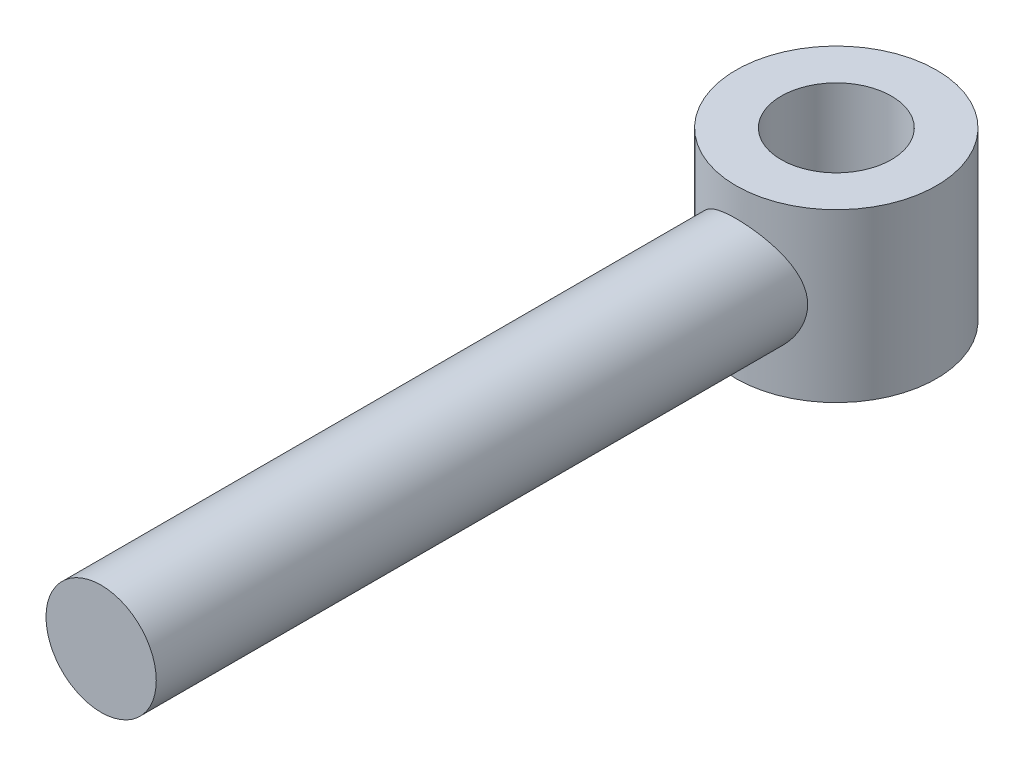
ISO-10303-21;
HEADER;
FILE_DESCRIPTION(('STEP AP214'),'2;1');
FILE_NAME('part.step','',(''),(''),'','','');
FILE_SCHEMA(('AUTOMOTIVE_DESIGN { 1 0 10303 214 1 1 1 1 }'));
ENDSEC;
DATA;
#1=APPLICATION_CONTEXT('core data for automotive mechanical design processes');
#2=APPLICATION_PROTOCOL_DEFINITION('international standard','automotive_design',2000,#1);
#3=PRODUCT_CONTEXT('',#1,'mechanical');
#4=PRODUCT('Part','Part','',(#3));
#5=PRODUCT_RELATED_PRODUCT_CATEGORY('part','',(#4));
#6=PRODUCT_DEFINITION_FORMATION('','',#4);
#7=PRODUCT_DEFINITION_CONTEXT('part definition',#1,'design');
#8=PRODUCT_DEFINITION('design','',#6,#7);
#9=PRODUCT_DEFINITION_SHAPE('','',#8);
#10=(LENGTH_UNIT() NAMED_UNIT(*) SI_UNIT(.MILLI.,.METRE.));
#11=(NAMED_UNIT(*) PLANE_ANGLE_UNIT() SI_UNIT($,.RADIAN.));
#12=(NAMED_UNIT(*) SI_UNIT($,.STERADIAN.) SOLID_ANGLE_UNIT());
#13=UNCERTAINTY_MEASURE_WITH_UNIT(LENGTH_MEASURE(1.E-05),#10,'distance_accuracy_value','');
#14=(GEOMETRIC_REPRESENTATION_CONTEXT(3) GLOBAL_UNCERTAINTY_ASSIGNED_CONTEXT((#13)) GLOBAL_UNIT_ASSIGNED_CONTEXT((#10,
#11,#12)) REPRESENTATION_CONTEXT('',''));
#15=CARTESIAN_POINT('',(0.,0.,0.));
#16=DIRECTION('',(0.,0.,1.));
#17=DIRECTION('',(1.,0.,0.));
#18=AXIS2_PLACEMENT_3D('',#15,#16,#17);
#19=CARTESIAN_POINT('',(0.,0.,20.));
#20=DIRECTION('',(0.,0.,-1.));
#21=DIRECTION('',(-1.,0.,0.));
#22=AXIS2_PLACEMENT_3D('',#19,#20,#21);
#23=CYLINDRICAL_SURFACE('',#22,1.65);
#24=CARTESIAN_POINT('',(0.,0.,20.));
#25=DIRECTION('',(0.,0.,1.));
#26=DIRECTION('',(1.,0.,0.));
#27=AXIS2_PLACEMENT_3D('',#24,#25,#26);
#28=CIRCLE('',#27,1.65);
#29=CARTESIAN_POINT('',(1.65,0.,20.));
#30=VERTEX_POINT('',#29);
#31=EDGE_CURVE('E40',#30,#30,#28,.T.);
#32=ORIENTED_EDGE('',*,*,#31,.F.);
#33=EDGE_LOOP('',(#32));
#34=FACE_BOUND('',#33,.T.);
#35=CARTESIAN_POINT('',(-1.65,0.,0.505493963273512));
#36=CARTESIAN_POINT('',(-1.64999358115515,0.0845622441242158,0.505502907291454));
#37=CARTESIAN_POINT('',(-1.64345412095508,0.169198419643748,0.509842783046335));
#38=CARTESIAN_POINT('',(-1.61768357796129,0.335758010656105,0.526523054720934));
#39=CARTESIAN_POINT('',(-1.5984310983052,0.417676607737088,0.538876938133396));
#40=CARTESIAN_POINT('',(-1.54839133504121,0.576058158341647,0.569695144240605));
#41=CARTESIAN_POINT('',(-1.51767597794516,0.652551663639783,0.588121282537674));
#42=CARTESIAN_POINT('',(-1.44580368027316,0.799270749323263,0.62894573960704));
#43=CARTESIAN_POINT('',(-1.40464456372702,0.869495019378769,0.651344885867393));
#44=CARTESIAN_POINT('',(-1.30818987552103,1.0094930204861,0.700342271694853));
#45=CARTESIAN_POINT('',(-1.25188597568528,1.07850385692035,0.72713610292843));
#46=CARTESIAN_POINT('',(-1.12882249865068,1.20671542475616,0.780334021223294));
#47=CARTESIAN_POINT('',(-1.06205670422282,1.26591027944563,0.806737866250299));
#48=CARTESIAN_POINT('',(-0.912984038802343,1.37781278752496,0.858882553339562));
#49=CARTESIAN_POINT('',(-0.829835009326254,1.42952708912563,0.884371828723282));
#50=CARTESIAN_POINT('',(-0.654349556397894,1.51787790618033,0.929163774647794));
#51=CARTESIAN_POINT('',(-0.562020200659685,1.55452591089576,0.948471156884162));
#52=CARTESIAN_POINT('',(-0.378922854343172,1.60849398479963,0.977293823303904));
#53=CARTESIAN_POINT('',(-0.288663762188309,1.62716814327195,0.987490006205549));
#54=CARTESIAN_POINT('',(-0.105768848971925,1.64917477835194,0.99953120217528));
#55=CARTESIAN_POINT('',(-0.0131348834272881,1.65251888599857,1.00138254652496));
#56=CARTESIAN_POINT('',(0.161456942743377,1.6441598762631,0.996791263837074));
#57=CARTESIAN_POINT('',(0.243517036042416,1.63399569896197,0.991196805882625));
#58=CARTESIAN_POINT('',(0.404548934713679,1.60174386066673,0.973701390906371));
#59=CARTESIAN_POINT('',(0.483520502425807,1.57965528402605,0.961799949587434));
#60=CARTESIAN_POINT('',(0.637279429786406,1.52418240454989,0.932587921332845));
#61=CARTESIAN_POINT('',(0.712012587065491,1.49067904874512,0.915220477375491));
#62=CARTESIAN_POINT('',(0.854941741305337,1.41356855385775,0.876554219394163));
#63=CARTESIAN_POINT('',(0.923135637298119,1.36995818281495,0.855254148262444));
#64=CARTESIAN_POINT('',(1.05891717191853,1.26851524995847,0.807918143824378));
#65=CARTESIAN_POINT('',(1.12564617195586,1.2096560691274,0.781619201725346));
#66=CARTESIAN_POINT('',(1.24879377983835,1.08207579455025,0.728556379997795));
#67=CARTESIAN_POINT('',(1.3052016470546,1.01334455874152,0.701792047413865));
#68=CARTESIAN_POINT('',(1.41104757147093,0.860702045770571,0.648162607413785));
#69=CARTESIAN_POINT('',(1.45943898084593,0.77598782502349,0.621494935575282));
#70=CARTESIAN_POINT('',(1.54096072440202,0.5979123412443,0.574426694548113));
#71=CARTESIAN_POINT('',(1.57410870202277,0.504561226104887,0.554018889066321));
#72=CARTESIAN_POINT('',(1.621324807476,0.319617566085951,0.524288688853718));
#73=CARTESIAN_POINT('',(1.63671808149072,0.228492292818842,0.514203881757541));
#74=CARTESIAN_POINT('',(1.65197600548299,0.0444385673954552,0.504211322839311));
#75=CARTESIAN_POINT('',(1.65185841284551,-0.048487701005198,0.504291933285543));
#76=CARTESIAN_POINT('',(1.63731066997579,-0.218980696775525,0.51381291635781));
#77=CARTESIAN_POINT('',(1.6249632757909,-0.296816762788183,0.521891182807725));
#78=CARTESIAN_POINT('',(1.58963092545288,-0.449094842708403,0.544308983162269));
#79=CARTESIAN_POINT('',(1.56664130047228,-0.523535351197223,0.558651264981769));
#80=CARTESIAN_POINT('',(1.50974087534156,-0.670568414340693,0.592647010529621));
#81=CARTESIAN_POINT('',(1.47541058671725,-0.742950820695036,0.612498861958533));
#82=CARTESIAN_POINT('',(1.39715088074391,-0.881361532982981,0.655175256281805));
#83=CARTESIAN_POINT('',(1.35321671440463,-0.947386671982585,0.67800126759515));
#84=CARTESIAN_POINT('',(1.24890384728535,-1.08217598283305,0.728387459802587));
#85=CARTESIAN_POINT('',(1.18702256034847,-1.14971665545364,0.756124712105424));
#86=CARTESIAN_POINT('',(1.05259034248067,-1.27394463458245,0.810214664772877));
#87=CARTESIAN_POINT('',(0.980033198593373,-1.33062557660595,0.836566546699512));
#88=CARTESIAN_POINT('',(0.821591432017619,-1.43418356477834,0.886558861743433));
#89=CARTESIAN_POINT('',(0.735218364495385,-1.48041980778174,0.909994762848855));
#90=CARTESIAN_POINT('',(0.554269536180263,-1.55721430537587,0.949802248986286));
#91=CARTESIAN_POINT('',(0.459702424085392,-1.58778886056153,0.966181176042924));
#92=CARTESIAN_POINT('',(0.275417797995456,-1.62930611839183,0.988623250679751));
#93=CARTESIAN_POINT('',(0.186187129425337,-1.64193096934435,0.995567054324279));
#94=CARTESIAN_POINT('',(0.00661676308886458,-1.65243189343455,1.00133436858647));
#95=CARTESIAN_POINT('',(-0.0837223254250938,-1.65031573581962,1.00016215675142));
#96=CARTESIAN_POINT('',(-0.254358366297032,-1.63233007153813,0.990310424275243));
#97=CARTESIAN_POINT('',(-0.334831363047834,-1.61770633320566,0.982311046718285));
#98=CARTESIAN_POINT('',(-0.491985833876879,-1.57703517800952,0.960447010253794));
#99=CARTESIAN_POINT('',(-0.568666854326148,-1.55098639804466,0.946581651493577));
#100=CARTESIAN_POINT('',(-0.719080279481093,-1.48738736796038,0.91359875185443));
#101=CARTESIAN_POINT('',(-0.792622296205403,-1.44947440595497,0.894317879409316));
#102=CARTESIAN_POINT('',(-0.932542405269455,-1.36367449851232,0.85231650614788));
#103=CARTESIAN_POINT('',(-0.99891758384472,-1.31578351940048,0.829594615296545));
#104=CARTESIAN_POINT('',(-1.13072210629174,-1.20507399834962,0.779745171250151));
#105=CARTESIAN_POINT('',(-1.19516495605846,-1.14117216627433,0.752411459408138));
#106=CARTESIAN_POINT('',(-1.31290440702821,-1.00349286244808,0.698238785370544));
#107=CARTESIAN_POINT('',(-1.36618742691371,-0.929703534726652,0.671400461841619));
#108=CARTESIAN_POINT('',(-1.46345962344263,-0.76827599994856,0.619451080889308));
#109=CARTESIAN_POINT('',(-1.50659692748028,-0.680043601407346,0.594572990896039));
#110=CARTESIAN_POINT('',(-1.57680093269354,-0.495821199591316,0.552528855842846));
#111=CARTESIAN_POINT('',(-1.60391885150154,-0.399857047171827,0.535338275367573));
#112=CARTESIAN_POINT('',(-1.6313948659609,-0.252191216941535,0.517669254132097));
#113=CARTESIAN_POINT('',(-1.6383544404993,-0.20212523584003,0.513130626131419));
#114=CARTESIAN_POINT('',(-1.64765888075615,-0.101381687592519,0.507040332364648));
#115=CARTESIAN_POINT('',(-1.65000384878586,-0.0507041340308588,0.505488600375576));
#116=CARTESIAN_POINT('',(-1.65,0.,0.505493963273512));
#117=B_SPLINE_CURVE_WITH_KNOTS('',3,(#35,#36,#37,#38,#39,#40,#41,#42,#43,#44,#45,#46,#47,#48,
#49,#50,#51,#52,#53,#54,#55,#56,#57,#58,#59,#60,#61,#62,#63,#64,#65,#66,#67,#68,#69,#70,#71,#72,
#73,#74,#75,#76,#77,#78,#79,#80,#81,#82,#83,#84,#85,#86,#87,#88,#89,#90,#91,#92,#93,#94,#95,#96,
#97,#98,#99,#100,#101,#102,#103,#104,#105,#106,#107,#108,#109,#110,#111,#112,#113,#114,#115,
#116),.UNSPECIFIED.,.T.,.F.,(4,2,2,2,2,2,2,2,2,2,2,2,2,2,2,2,2,2,2,2,2,2,2,2,2,2,2,2,2,2,2,2,2,
2,2,2,2,2,2,2,4),(0.,0.253471464978916,0.507370630471963,0.759702723718416,1.01208743389991,
1.28998079678324,1.56803993512379,1.86997289364919,2.17167517502776,2.44828286528195,
2.72468065617498,2.9721366309398,3.21961160997027,3.46975098230538,3.71997045333205,
3.99717687977863,4.27467015892956,4.57652503396566,4.8780296436106,5.15517475627462,
5.43200258623579,5.66859462056208,5.90529054812099,6.15196333618108,6.39875837770523,
6.68465599353131,6.97072065421035,7.27125286686233,7.57147164850534,7.84111747203333,
8.1106211895083,8.35604451303954,8.60149712555499,8.85533990697406,9.10928550569675,
9.39243346006448,9.67592402360688,9.97823556729934,10.2795752459721,10.4315619419379,
10.5835452681421),.UNSPECIFIED.);
#118=CARTESIAN_POINT('',(-1.65,0.,0.505493963273512));
#119=VERTEX_POINT('',#118);
#120=EDGE_CURVE('E10',#119,#119,#117,.T.);
#121=ORIENTED_EDGE('',*,*,#120,.F.);
#122=EDGE_LOOP('',(#121));
#123=FACE_BOUND('',#122,.T.);
#124=ADVANCED_FACE('F30',(#34,#123),#23,.T.);
#125=CARTESIAN_POINT('',(0.,0.,20.));
#126=DIRECTION('',(0.,0.,1.));
#127=DIRECTION('',(1.,0.,0.));
#128=AXIS2_PLACEMENT_3D('',#125,#126,#127);
#129=PLANE('',#128);
#130=ORIENTED_EDGE('',*,*,#31,.T.);
#131=EDGE_LOOP('',(#130));
#132=FACE_BOUND('',#131,.T.);
#133=ADVANCED_FACE('F77',(#132),#129,.T.);
#134=CARTESIAN_POINT('',(0.,2.5,-2.));
#135=DIRECTION('',(0.,-1.,0.));
#136=DIRECTION('',(0.,0.,-1.));
#137=AXIS2_PLACEMENT_3D('',#134,#135,#136);
#138=CYLINDRICAL_SURFACE('',#137,3.);
#139=CARTESIAN_POINT('',(0.,-2.5,-2.));
#140=DIRECTION('',(0.,1.,0.));
#141=DIRECTION('',(0.,0.,1.));
#142=AXIS2_PLACEMENT_3D('',#139,#140,#141);
#143=CIRCLE('',#142,3.);
#144=CARTESIAN_POINT('',(0.,-2.5,1.));
#145=VERTEX_POINT('',#144);
#146=EDGE_CURVE('E48',#145,#145,#143,.T.);
#147=ORIENTED_EDGE('',*,*,#146,.T.);
#148=EDGE_LOOP('',(#147));
#149=FACE_BOUND('',#148,.T.);
#150=CARTESIAN_POINT('',(0.,2.5,-2.));
#151=DIRECTION('',(0.,1.,0.));
#152=DIRECTION('',(0.,0.,1.));
#153=AXIS2_PLACEMENT_3D('',#150,#151,#152);
#154=CIRCLE('',#153,3.);
#155=CARTESIAN_POINT('',(0.,2.5,1.));
#156=VERTEX_POINT('',#155);
#157=EDGE_CURVE('E44',#156,#156,#154,.T.);
#158=ORIENTED_EDGE('',*,*,#157,.F.);
#159=EDGE_LOOP('',(#158));
#160=FACE_BOUND('',#159,.T.);
#161=ORIENTED_EDGE('',*,*,#120,.T.);
#162=EDGE_LOOP('',(#161));
#163=FACE_BOUND('',#162,.T.);
#164=ADVANCED_FACE('F72',(#149,#160,#163),#138,.T.);
#165=CARTESIAN_POINT('',(0.,2.5,-2.));
#166=DIRECTION('',(0.,1.,0.));
#167=DIRECTION('',(0.,0.,1.));
#168=AXIS2_PLACEMENT_3D('',#165,#166,#167);
#169=PLANE('',#168);
#170=CARTESIAN_POINT('',(0.,2.5,-2.00107941551053));
#171=DIRECTION('',(0.,1.,0.));
#172=DIRECTION('',(0.,0.,1.));
#173=AXIS2_PLACEMENT_3D('',#170,#171,#172);
#174=CIRCLE('',#173,1.65);
#175=CARTESIAN_POINT('',(0.,2.5,-0.351079415510531));
#176=VERTEX_POINT('',#175);
#177=EDGE_CURVE('E54',#176,#176,#174,.T.);
#178=ORIENTED_EDGE('',*,*,#177,.F.);
#179=EDGE_LOOP('',(#178));
#180=FACE_BOUND('',#179,.T.);
#181=ORIENTED_EDGE('',*,*,#157,.T.);
#182=EDGE_LOOP('',(#181));
#183=FACE_BOUND('',#182,.T.);
#184=ADVANCED_FACE('F69',(#180,#183),#169,.T.);
#185=CARTESIAN_POINT('',(0.,-2.5,-2.));
#186=DIRECTION('',(0.,1.,0.));
#187=DIRECTION('',(0.,0.,1.));
#188=AXIS2_PLACEMENT_3D('',#185,#186,#187);
#189=PLANE('',#188);
#190=CARTESIAN_POINT('',(0.,-2.5,-2.00107941551053));
#191=DIRECTION('',(0.,1.,0.));
#192=DIRECTION('',(0.,0.,1.));
#193=AXIS2_PLACEMENT_3D('',#190,#191,#192);
#194=CIRCLE('',#193,1.65);
#195=CARTESIAN_POINT('',(0.,-2.5,-0.351079415510531));
#196=VERTEX_POINT('',#195);
#197=EDGE_CURVE('E52',#196,#196,#194,.T.);
#198=ORIENTED_EDGE('',*,*,#197,.T.);
#199=EDGE_LOOP('',(#198));
#200=FACE_BOUND('',#199,.T.);
#201=ORIENTED_EDGE('',*,*,#146,.F.);
#202=EDGE_LOOP('',(#201));
#203=FACE_BOUND('',#202,.T.);
#204=ADVANCED_FACE('F60',(#200,#203),#189,.F.);
#205=CARTESIAN_POINT('',(0.,-2.5,-2.00107941551053));
#206=DIRECTION('',(0.,1.,0.));
#207=DIRECTION('',(0.,0.,1.));
#208=AXIS2_PLACEMENT_3D('',#205,#206,#207);
#209=CYLINDRICAL_SURFACE('',#208,1.65);
#210=ORIENTED_EDGE('',*,*,#197,.F.);
#211=EDGE_LOOP('',(#210));
#212=FACE_BOUND('',#211,.T.);
#213=ORIENTED_EDGE('',*,*,#177,.T.);
#214=EDGE_LOOP('',(#213));
#215=FACE_BOUND('',#214,.T.);
#216=ADVANCED_FACE('F63',(#212,#215),#209,.F.);
#217=CLOSED_SHELL('',(#124,#133,#164,#184,#204,#216));
#218=MANIFOLD_SOLID_BREP('B2',#217);
#219=ADVANCED_BREP_SHAPE_REPRESENTATION('',(#18,#218),#14);
#220=SHAPE_DEFINITION_REPRESENTATION(#9,#219);
ENDSEC;
END-ISO-10303-21;
